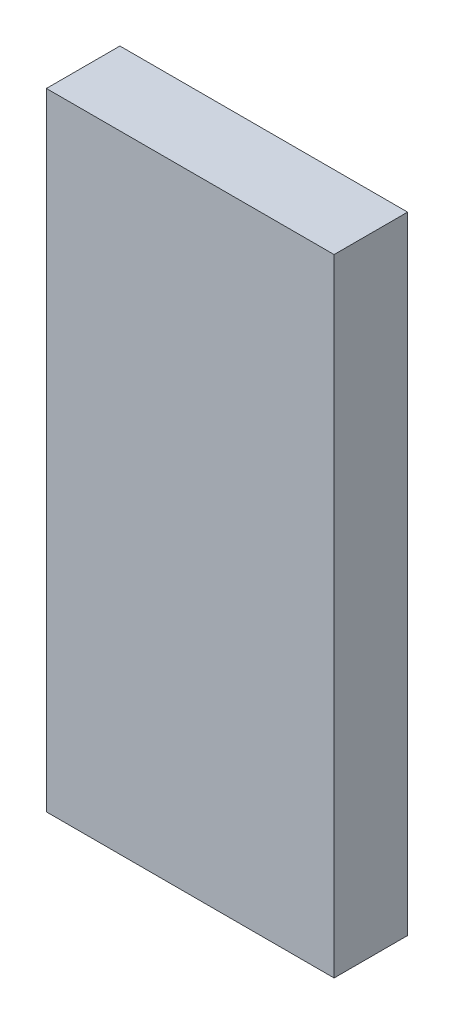
ISO-10303-21;
HEADER;
FILE_DESCRIPTION(('STEP AP214'),'2;1');
FILE_NAME('part.step','',(''),(''),'','','');
FILE_SCHEMA(('AUTOMOTIVE_DESIGN { 1 0 10303 214 1 1 1 1 }'));
ENDSEC;
DATA;
#1=APPLICATION_CONTEXT('core data for automotive mechanical design processes');
#2=APPLICATION_PROTOCOL_DEFINITION('international standard','automotive_design',2000,#1);
#3=PRODUCT_CONTEXT('',#1,'mechanical');
#4=PRODUCT('Part','Part','',(#3));
#5=PRODUCT_RELATED_PRODUCT_CATEGORY('part','',(#4));
#6=PRODUCT_DEFINITION_FORMATION('','',#4);
#7=PRODUCT_DEFINITION_CONTEXT('part definition',#1,'design');
#8=PRODUCT_DEFINITION('design','',#6,#7);
#9=PRODUCT_DEFINITION_SHAPE('','',#8);
#10=(LENGTH_UNIT() NAMED_UNIT(*) SI_UNIT(.MILLI.,.METRE.));
#11=(NAMED_UNIT(*) PLANE_ANGLE_UNIT() SI_UNIT($,.RADIAN.));
#12=(NAMED_UNIT(*) SI_UNIT($,.STERADIAN.) SOLID_ANGLE_UNIT());
#13=UNCERTAINTY_MEASURE_WITH_UNIT(LENGTH_MEASURE(1.E-05),#10,'distance_accuracy_value','');
#14=(GEOMETRIC_REPRESENTATION_CONTEXT(3) GLOBAL_UNCERTAINTY_ASSIGNED_CONTEXT((#13)) GLOBAL_UNIT_ASSIGNED_CONTEXT((#10,
#11,#12)) REPRESENTATION_CONTEXT('',''));
#15=CARTESIAN_POINT('',(0.,0.,0.));
#16=DIRECTION('',(0.,0.,1.));
#17=DIRECTION('',(1.,0.,0.));
#18=AXIS2_PLACEMENT_3D('',#15,#16,#17);
#19=CARTESIAN_POINT('',(-2.25000058,4.90000036,1.15000024));
#20=DIRECTION('',(0.,0.,-1.));
#21=DIRECTION('',(-1.,0.,0.));
#22=AXIS2_PLACEMENT_3D('',#19,#20,#21);
#23=PLANE('',#22);
#24=DIRECTION('',(1.,0.,0.));
#25=VECTOR('',#24,1.);
#26=CARTESIAN_POINT('',(-2.25000058,-4.90000036,1.15000024));
#27=LINE('',#26,#25);
#28=CARTESIAN_POINT('',(-2.25000058,-4.90000036,1.15000024));
#29=VERTEX_POINT('',#28);
#30=CARTESIAN_POINT('',(2.24999931,-4.90000036,1.15000024));
#31=VERTEX_POINT('',#30);
#32=EDGE_CURVE('E54',#29,#31,#27,.T.);
#33=ORIENTED_EDGE('',*,*,#32,.T.);
#34=DIRECTION('',(-2.59183589844991E-07,-0.999999999999966,0.));
#35=VECTOR('',#34,1.);
#36=CARTESIAN_POINT('',(2.24999804,-4.90000036,1.15000024));
#37=LINE('',#36,#35);
#38=CARTESIAN_POINT('',(2.25000058000001,4.90000163,1.15000024));
#39=VERTEX_POINT('',#38);
#40=EDGE_CURVE('E56',#31,#39,#37,.F.);
#41=ORIENTED_EDGE('',*,*,#40,.T.);
#42=DIRECTION('',(0.999999999999841,5.6444429827581E-07,0.));
#43=VECTOR('',#42,1.);
#44=CARTESIAN_POINT('',(2.25000058,4.9000029,1.15000024));
#45=LINE('',#44,#43);
#46=CARTESIAN_POINT('',(-2.25000058,4.90000036,1.15000024));
#47=VERTEX_POINT('',#46);
#48=EDGE_CURVE('E19',#39,#47,#45,.F.);
#49=ORIENTED_EDGE('',*,*,#48,.T.);
#50=DIRECTION('',(0.,1.,0.));
#51=VECTOR('',#50,1.);
#52=CARTESIAN_POINT('',(-2.25000058,4.90000036,1.15000024));
#53=LINE('',#52,#51);
#54=EDGE_CURVE('E79',#47,#29,#53,.F.);
#55=ORIENTED_EDGE('',*,*,#54,.T.);
#56=EDGE_LOOP('',(#33,#41,#49,#55));
#57=FACE_BOUND('',#56,.T.);
#58=ADVANCED_FACE('F16',(#57),#23,.F.);
#59=CARTESIAN_POINT('',(2.25000058,4.9000029,0.));
#60=DIRECTION('',(5.6444429827581E-07,-0.999999999999841,0.));
#61=DIRECTION('',(0.999999999999841,5.6444429827581E-07,0.));
#62=AXIS2_PLACEMENT_3D('',#59,#60,#61);
#63=PLANE('',#62);
#64=DIRECTION('',(0.,0.,-1.));
#65=VECTOR('',#64,1.);
#66=CARTESIAN_POINT('',(-2.25000058,4.90000036,0.));
#67=LINE('',#66,#65);
#68=CARTESIAN_POINT('',(-2.25000058,4.90000036,0.));
#69=VERTEX_POINT('',#68);
#70=EDGE_CURVE('E67',#69,#47,#67,.F.);
#71=ORIENTED_EDGE('',*,*,#70,.T.);
#72=ORIENTED_EDGE('',*,*,#48,.F.);
#73=DIRECTION('',(0.,0.,1.));
#74=VECTOR('',#73,1.);
#75=CARTESIAN_POINT('',(2.25000058000003,4.9000029,0.));
#76=LINE('',#75,#74);
#77=CARTESIAN_POINT('',(2.25000058000001,4.900002265,0.));
#78=VERTEX_POINT('',#77);
#79=EDGE_CURVE('E62',#39,#78,#76,.F.);
#80=ORIENTED_EDGE('',*,*,#79,.T.);
#81=DIRECTION('',(-1.,0.,0.));
#82=VECTOR('',#81,1.);
#83=CARTESIAN_POINT('',(-2.25000058,4.90000036,0.));
#84=LINE('',#83,#82);
#85=EDGE_CURVE('E82',#69,#78,#84,.F.);
#86=ORIENTED_EDGE('',*,*,#85,.F.);
#87=EDGE_LOOP('',(#71,#72,#80,#86));
#88=FACE_BOUND('',#87,.T.);
#89=ADVANCED_FACE('F64',(#88),#63,.F.);
#90=CARTESIAN_POINT('',(2.24999804,-4.90000036,0.));
#91=DIRECTION('',(-0.999999999999966,2.59183589844991E-07,0.));
#92=DIRECTION('',(-2.59183589844991E-07,-0.999999999999966,0.));
#93=AXIS2_PLACEMENT_3D('',#90,#91,#92);
#94=PLANE('',#93);
#95=ORIENTED_EDGE('',*,*,#79,.F.);
#96=ORIENTED_EDGE('',*,*,#40,.F.);
#97=DIRECTION('',(0.,0.,1.));
#98=VECTOR('',#97,1.);
#99=CARTESIAN_POINT('',(2.24999804,-4.90000036,0.));
#100=LINE('',#99,#98);
#101=CARTESIAN_POINT('',(2.249998675,-4.90000036,0.));
#102=VERTEX_POINT('',#101);
#103=EDGE_CURVE('E74',#31,#102,#100,.F.);
#104=ORIENTED_EDGE('',*,*,#103,.T.);
#105=DIRECTION('',(0.,1.,0.));
#106=VECTOR('',#105,1.);
#107=CARTESIAN_POINT('',(2.25000058,4.90000036,0.));
#108=LINE('',#107,#106);
#109=EDGE_CURVE('E71',#78,#102,#108,.F.);
#110=ORIENTED_EDGE('',*,*,#109,.F.);
#111=EDGE_LOOP('',(#95,#96,#104,#110));
#112=FACE_BOUND('',#111,.T.);
#113=ADVANCED_FACE('F69',(#112),#94,.F.);
#114=CARTESIAN_POINT('',(-2.25000058,-4.90000036,0.));
#115=DIRECTION('',(0.,1.,0.));
#116=DIRECTION('',(0.,0.,1.));
#117=AXIS2_PLACEMENT_3D('',#114,#115,#116);
#118=PLANE('',#117);
#119=ORIENTED_EDGE('',*,*,#103,.F.);
#120=ORIENTED_EDGE('',*,*,#32,.F.);
#121=DIRECTION('',(0.,0.,-1.));
#122=VECTOR('',#121,1.);
#123=CARTESIAN_POINT('',(-2.25000058,-4.90000036,0.));
#124=LINE('',#123,#122);
#125=CARTESIAN_POINT('',(-2.25000058,-4.90000036,0.));
#126=VERTEX_POINT('',#125);
#127=EDGE_CURVE('E34',#29,#126,#124,.T.);
#128=ORIENTED_EDGE('',*,*,#127,.T.);
#129=DIRECTION('',(-1.,0.,0.));
#130=VECTOR('',#129,1.);
#131=CARTESIAN_POINT('',(-2.25000058,-4.90000036,0.));
#132=LINE('',#131,#130);
#133=EDGE_CURVE('E25',#102,#126,#132,.T.);
#134=ORIENTED_EDGE('',*,*,#133,.F.);
#135=EDGE_LOOP('',(#119,#120,#128,#134));
#136=FACE_BOUND('',#135,.T.);
#137=ADVANCED_FACE('F88',(#136),#118,.F.);
#138=CARTESIAN_POINT('',(-2.25000058,4.90000036,0.));
#139=DIRECTION('',(1.,0.,0.));
#140=DIRECTION('',(0.,0.,-1.));
#141=AXIS2_PLACEMENT_3D('',#138,#139,#140);
#142=PLANE('',#141);
#143=ORIENTED_EDGE('',*,*,#127,.F.);
#144=ORIENTED_EDGE('',*,*,#54,.F.);
#145=ORIENTED_EDGE('',*,*,#70,.F.);
#146=DIRECTION('',(0.,1.,0.));
#147=VECTOR('',#146,1.);
#148=CARTESIAN_POINT('',(-2.25000058,4.90000036,0.));
#149=LINE('',#148,#147);
#150=EDGE_CURVE('E11',#126,#69,#149,.T.);
#151=ORIENTED_EDGE('',*,*,#150,.F.);
#152=EDGE_LOOP('',(#143,#144,#145,#151));
#153=FACE_BOUND('',#152,.T.);
#154=ADVANCED_FACE('F90',(#153),#142,.F.);
#155=CARTESIAN_POINT('',(-2.25000058,4.90000036,0.));
#156=DIRECTION('',(0.,0.,-1.));
#157=DIRECTION('',(-1.,0.,0.));
#158=AXIS2_PLACEMENT_3D('',#155,#156,#157);
#159=PLANE('',#158);
#160=ORIENTED_EDGE('',*,*,#133,.T.);
#161=ORIENTED_EDGE('',*,*,#150,.T.);
#162=ORIENTED_EDGE('',*,*,#85,.T.);
#163=ORIENTED_EDGE('',*,*,#109,.T.);
#164=EDGE_LOOP('',(#160,#161,#162,#163));
#165=FACE_BOUND('',#164,.T.);
#166=ADVANCED_FACE('F87',(#165),#159,.T.);
#167=CLOSED_SHELL('',(#58,#89,#113,#137,#154,#166));
#168=MANIFOLD_SOLID_BREP('B1',#167);
#169=ADVANCED_BREP_SHAPE_REPRESENTATION('',(#18,#168),#14);
#170=SHAPE_DEFINITION_REPRESENTATION(#9,#169);
ENDSEC;
END-ISO-10303-21;
